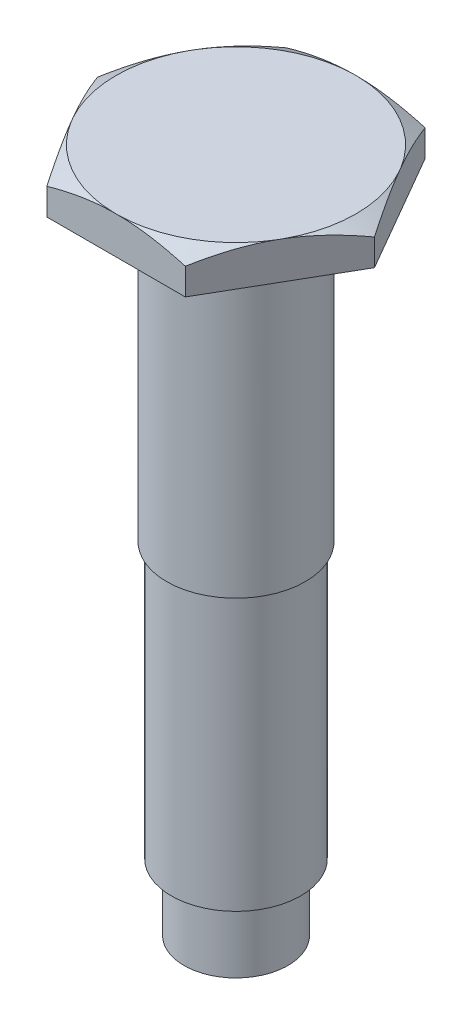
ISO-10303-21;
HEADER;
FILE_DESCRIPTION(('STEP AP214'),'2;1');
FILE_NAME('part.step','',(''),(''),'','','');
FILE_SCHEMA(('AUTOMOTIVE_DESIGN { 1 0 10303 214 1 1 1 1 }'));
ENDSEC;
DATA;
#1=APPLICATION_CONTEXT('core data for automotive mechanical design processes');
#2=APPLICATION_PROTOCOL_DEFINITION('international standard','automotive_design',2000,#1);
#3=PRODUCT_CONTEXT('',#1,'mechanical');
#4=PRODUCT('Part','Part','',(#3));
#5=PRODUCT_RELATED_PRODUCT_CATEGORY('part','',(#4));
#6=PRODUCT_DEFINITION_FORMATION('','',#4);
#7=PRODUCT_DEFINITION_CONTEXT('part definition',#1,'design');
#8=PRODUCT_DEFINITION('design','',#6,#7);
#9=PRODUCT_DEFINITION_SHAPE('','',#8);
#10=(LENGTH_UNIT() NAMED_UNIT(*) SI_UNIT(.MILLI.,.METRE.));
#11=(NAMED_UNIT(*) PLANE_ANGLE_UNIT() SI_UNIT($,.RADIAN.));
#12=(NAMED_UNIT(*) SI_UNIT($,.STERADIAN.) SOLID_ANGLE_UNIT());
#13=UNCERTAINTY_MEASURE_WITH_UNIT(LENGTH_MEASURE(1.E-05),#10,'distance_accuracy_value','');
#14=(GEOMETRIC_REPRESENTATION_CONTEXT(3) GLOBAL_UNCERTAINTY_ASSIGNED_CONTEXT((#13)) GLOBAL_UNIT_ASSIGNED_CONTEXT((#10,
#11,#12)) REPRESENTATION_CONTEXT('',''));
#15=CARTESIAN_POINT('',(0.,0.,0.));
#16=DIRECTION('',(0.,0.,1.));
#17=DIRECTION('',(1.,0.,0.));
#18=AXIS2_PLACEMENT_3D('',#15,#16,#17);
#19=CARTESIAN_POINT('',(0.,-24.3,0.));
#20=DIRECTION('',(0.,1.,0.));
#21=DIRECTION('',(0.,0.,1.));
#22=AXIS2_PLACEMENT_3D('',#19,#20,#21);
#23=CYLINDRICAL_SURFACE('',#22,2.425);
#24=CARTESIAN_POINT('',(0.,-11.5,0.));
#25=DIRECTION('',(0.,-1.,0.));
#26=DIRECTION('',(0.,0.,-1.));
#27=AXIS2_PLACEMENT_3D('',#24,#25,#26);
#28=CIRCLE('',#27,2.425);
#29=CARTESIAN_POINT('',(0.,-11.5,-2.425));
#30=VERTEX_POINT('',#29);
#31=EDGE_CURVE('E57',#30,#30,#28,.T.);
#32=ORIENTED_EDGE('',*,*,#31,.T.);
#33=EDGE_LOOP('',(#32));
#34=FACE_BOUND('',#33,.T.);
#35=CARTESIAN_POINT('',(0.,-21.8,0.));
#36=DIRECTION('',(0.,-1.,0.));
#37=DIRECTION('',(0.,0.,-1.));
#38=AXIS2_PLACEMENT_3D('',#35,#36,#37);
#39=CIRCLE('',#38,2.425);
#40=CARTESIAN_POINT('',(0.,-21.8,-2.425));
#41=VERTEX_POINT('',#40);
#42=EDGE_CURVE('E152',#41,#41,#39,.T.);
#43=ORIENTED_EDGE('',*,*,#42,.F.);
#44=EDGE_LOOP('',(#43));
#45=FACE_BOUND('',#44,.T.);
#46=ADVANCED_FACE('F52',(#34,#45),#23,.T.);
#47=CARTESIAN_POINT('',(0.,-21.8,0.));
#48=DIRECTION('',(0.,-1.,0.));
#49=DIRECTION('',(0.,0.,-1.));
#50=AXIS2_PLACEMENT_3D('',#47,#48,#49);
#51=PLANE('',#50);
#52=CARTESIAN_POINT('',(0.,-21.8,0.));
#53=DIRECTION('',(0.,-1.,0.));
#54=DIRECTION('',(0.,0.,-1.));
#55=AXIS2_PLACEMENT_3D('',#52,#53,#54);
#56=CIRCLE('',#55,1.95);
#57=CARTESIAN_POINT('',(0.,-21.8,-1.95));
#58=VERTEX_POINT('',#57);
#59=EDGE_CURVE('E204',#58,#58,#56,.T.);
#60=ORIENTED_EDGE('',*,*,#59,.F.);
#61=EDGE_LOOP('',(#60));
#62=FACE_BOUND('',#61,.T.);
#63=ORIENTED_EDGE('',*,*,#42,.T.);
#64=EDGE_LOOP('',(#63));
#65=FACE_BOUND('',#64,.T.);
#66=ADVANCED_FACE('F285',(#62,#65),#51,.T.);
#67=CARTESIAN_POINT('',(0.,-21.8,0.));
#68=DIRECTION('',(0.,-1.,0.));
#69=DIRECTION('',(0.,0.,-1.));
#70=AXIS2_PLACEMENT_3D('',#67,#68,#69);
#71=CYLINDRICAL_SURFACE('',#70,1.95);
#72=ORIENTED_EDGE('',*,*,#59,.T.);
#73=EDGE_LOOP('',(#72));
#74=FACE_BOUND('',#73,.T.);
#75=CARTESIAN_POINT('',(0.,-24.3,0.));
#76=DIRECTION('',(0.,-1.,0.));
#77=DIRECTION('',(0.,0.,-1.));
#78=AXIS2_PLACEMENT_3D('',#75,#76,#77);
#79=CIRCLE('',#78,1.95);
#80=CARTESIAN_POINT('',(0.,-24.3,-1.95));
#81=VERTEX_POINT('',#80);
#82=EDGE_CURVE('E208',#81,#81,#79,.T.);
#83=ORIENTED_EDGE('',*,*,#82,.F.);
#84=EDGE_LOOP('',(#83));
#85=FACE_BOUND('',#84,.T.);
#86=ADVANCED_FACE('F290',(#74,#85),#71,.T.);
#87=CARTESIAN_POINT('',(0.,-24.3,0.));
#88=DIRECTION('',(0.,-1.,0.));
#89=DIRECTION('',(0.,0.,-1.));
#90=AXIS2_PLACEMENT_3D('',#87,#88,#89);
#91=PLANE('',#90);
#92=ORIENTED_EDGE('',*,*,#82,.T.);
#93=EDGE_LOOP('',(#92));
#94=FACE_BOUND('',#93,.T.);
#95=ADVANCED_FACE('F305',(#94),#91,.T.);
#96=CARTESIAN_POINT('',(0.,-11.5,0.));
#97=DIRECTION('',(0.,1.,0.));
#98=DIRECTION('',(0.,0.,1.));
#99=AXIS2_PLACEMENT_3D('',#96,#97,#98);
#100=CYLINDRICAL_SURFACE('',#99,2.6);
#101=CARTESIAN_POINT('',(0.,-11.5,0.));
#102=DIRECTION('',(0.,-1.,0.));
#103=DIRECTION('',(0.,0.,-1.));
#104=AXIS2_PLACEMENT_3D('',#101,#102,#103);
#105=CIRCLE('',#104,2.6);
#106=CARTESIAN_POINT('',(0.,-11.5,-2.6));
#107=VERTEX_POINT('',#106);
#108=EDGE_CURVE('E215',#107,#107,#105,.T.);
#109=ORIENTED_EDGE('',*,*,#108,.F.);
#110=EDGE_LOOP('',(#109));
#111=FACE_BOUND('',#110,.T.);
#112=CARTESIAN_POINT('',(0.,0.,0.));
#113=DIRECTION('',(0.,1.,0.));
#114=DIRECTION('',(0.,0.,1.));
#115=AXIS2_PLACEMENT_3D('',#112,#113,#114);
#116=CIRCLE('',#115,2.6);
#117=CARTESIAN_POINT('',(0.,0.,2.6));
#118=VERTEX_POINT('',#117);
#119=EDGE_CURVE('E13',#118,#118,#116,.F.);
#120=ORIENTED_EDGE('',*,*,#119,.T.);
#121=EDGE_LOOP('',(#120));
#122=FACE_BOUND('',#121,.T.);
#123=ADVANCED_FACE('F302',(#111,#122),#100,.T.);
#124=CARTESIAN_POINT('',(0.,-11.5,0.));
#125=DIRECTION('',(0.,-1.,0.));
#126=DIRECTION('',(0.,0.,-1.));
#127=AXIS2_PLACEMENT_3D('',#124,#125,#126);
#128=PLANE('',#127);
#129=ORIENTED_EDGE('',*,*,#31,.F.);
#130=EDGE_LOOP('',(#129));
#131=FACE_BOUND('',#130,.T.);
#132=ORIENTED_EDGE('',*,*,#108,.T.);
#133=EDGE_LOOP('',(#132));
#134=FACE_BOUND('',#133,.T.);
#135=ADVANCED_FACE('F300',(#131,#134),#128,.T.);
#136=CARTESIAN_POINT('',(0.,1.4,0.));
#137=DIRECTION('',(0.,-1.,0.));
#138=DIRECTION('',(0.,0.,1.));
#139=AXIS2_PLACEMENT_3D('',#136,#137,#138);
#140=CONICAL_SURFACE('',#139,4.5,1.0471975511966);
#141=CARTESIAN_POINT('',(7.02775373223216,-0.454124789273065,3.17442258198759));
#142=CARTESIAN_POINT('',(6.94595929433924,-0.377433019190193,3.03275045978052));
#143=CARTESIAN_POINT('',(6.86397192725755,-0.30155195790506,2.89074417441623));
#144=CARTESIAN_POINT('',(6.69952996979118,-0.151791197053433,2.6059223491884));
#145=CARTESIAN_POINT('',(6.61707532405409,-0.077911740847407,2.46310671345166));
#146=CARTESIAN_POINT('',(6.45137969842866,0.0676733695980147,2.1761134712765));
#147=CARTESIAN_POINT('',(6.36813706970453,0.139371540587463,2.03193300897072));
#148=CARTESIAN_POINT('',(6.20103601612468,0.279831230371152,1.74250549417213));
#149=CARTESIAN_POINT('',(6.11717761031257,0.34859283953742,1.59725847466382));
#150=CARTESIAN_POINT('',(5.94650734955145,0.484316646401146,1.30164891168453));
#151=CARTESIAN_POINT('',(5.85967623869026,0.551182431909525,1.15125301599531));
#152=CARTESIAN_POINT('',(5.68515450522659,0.680257160061499,0.848972506611236));
#153=CARTESIAN_POINT('',(5.59746393147591,0.742466365668553,0.697087977530198));
#154=CARTESIAN_POINT('',(5.42118428204018,0.861080845971696,0.391762668367075));
#155=CARTESIAN_POINT('',(5.33259607284332,0.917491222644589,0.238323389086572));
#156=CARTESIAN_POINT('',(5.15437972767932,1.02322633098802,-0.0703563754767021));
#157=CARTESIAN_POINT('',(5.06475172504421,1.07255196051071,-0.225596629821623));
#158=CARTESIAN_POINT('',(4.85082306804145,1.17932065353719,-0.596131932945389));
#159=CARTESIAN_POINT('',(4.72602759238872,1.23295723560288,-0.812284037330647));
#160=CARTESIAN_POINT('',(4.53752606457053,1.29798014863304,-1.1387782608161));
#161=CARTESIAN_POINT('',(4.47447512583005,1.31708228871089,-1.24798569017953));
#162=CARTESIAN_POINT('',(4.34801396674504,1.34966788109555,-1.46702284289882));
#163=CARTESIAN_POINT('',(4.28460379499038,1.36315207572337,-1.57685248209455));
#164=CARTESIAN_POINT('',(4.15828769213079,1.3839969781063,-1.79563839006147));
#165=CARTESIAN_POINT('',(4.09538469304001,1.39142837342597,-1.90458958043515));
#166=CARTESIAN_POINT('',(3.96947258411831,1.40021353929659,-2.12267575037568));
#167=CARTESIAN_POINT('',(3.90646347607119,1.40156741101706,-2.23181072685288));
#168=CARTESIAN_POINT('',(3.78048582752106,1.39815550680156,-2.45001041475978));
#169=CARTESIAN_POINT('',(3.71751728766221,1.39338963597678,-2.55907512507373));
#170=CARTESIAN_POINT('',(3.59176321771671,1.37788386249752,-2.7768875634779));
#171=CARTESIAN_POINT('',(3.52897769997846,1.36714356571949,-2.88563527018006));
#172=CARTESIAN_POINT('',(3.38184879498638,1.33525044365775,-3.14047000888832));
#173=CARTESIAN_POINT('',(3.29763046050635,1.31177164019821,-3.28634044313656));
#174=CARTESIAN_POINT('',(3.12996898161369,1.25557216182377,-3.57673864305079));
#175=CARTESIAN_POINT('',(3.04652596068327,1.22285003995282,-3.72126619483932));
#176=CARTESIAN_POINT('',(2.88044748570321,1.14940005301191,-4.00892255154833));
#177=CARTESIAN_POINT('',(2.79781291904045,1.10866424445279,-4.15204981946966));
#178=CARTESIAN_POINT('',(2.63345665629373,1.02046987040766,-4.43672321708913));
#179=CARTESIAN_POINT('',(2.55173493552456,0.973011487190809,-4.57826938954329));
#180=CARTESIAN_POINT('',(2.38818083127617,0.871907470927306,-4.86155340788791));
#181=CARTESIAN_POINT('',(2.30635897781793,0.818194179899496,-5.00327301524705));
#182=CARTESIAN_POINT('',(2.14352201608778,0.706057896456654,-5.28531490631381));
#183=CARTESIAN_POINT('',(2.06250698720276,0.647634445633891,-5.42563705251932));
#184=CARTESIAN_POINT('',(1.90124979545261,0.526954778850262,-5.70494270171646));
#185=CARTESIAN_POINT('',(1.82100721779255,0.46470076988874,-5.84392692315397));
#186=CARTESIAN_POINT('',(1.66115763399711,0.337008626902662,-6.12079452385642));
#187=CARTESIAN_POINT('',(1.58155064445506,0.271570410062163,-6.25867787438085));
#188=CARTESIAN_POINT('',(1.43980016942041,0.152286187773572,-6.50419689913789));
#189=CARTESIAN_POINT('',(1.377550718594,0.098941958337579,-6.61201611071249));
#190=CARTESIAN_POINT('',(1.25336222128168,-0.00915825365951011,-6.82711689777307));
#191=CARTESIAN_POINT('',(1.19142316242206,-0.0639141794002777,-6.93439849469092));
#192=CARTESIAN_POINT('',(1.06855937024202,-0.173990162223895,-7.14720482515734));
#193=CARTESIAN_POINT('',(1.00763136561662,-0.229295639253394,-7.25273522477232));
#194=CARTESIAN_POINT('',(0.886015406996071,-0.340958275081432,-7.46338024411431));
#195=CARTESIAN_POINT('',(0.825327457022315,-0.397315451408355,-7.56849485687605));
#196=CARTESIAN_POINT('',(0.764746267767833,-0.454124789273058,-7.67342455464776));
#197=B_SPLINE_CURVE_WITH_KNOTS('',3,(#141,#142,#143,#144,#145,#146,#147,#148,#149,#150,#151,
#152,#153,#154,#155,#156,#157,#158,#159,#160,#161,#162,#163,#164,#165,#166,#167,#168,#169,#170,
#171,#172,#173,#174,#175,#176,#177,#178,#179,#180,#181,#182,#183,#184,#185,#186,#187,#188,#189,
#190,#191,#192,#193,#194,#195,#196),.UNSPECIFIED.,.F.,.F.,(4,2,2,2,2,2,2,2,2,2,2,2,2,2,2,2,2,2,
2,2,2,2,2,2,2,2,2,4),(0.,0.542026372178205,1.08411835228508,1.62789791735099,2.17166073564649,
2.72987716868045,3.28806205464704,3.84575155274402,4.40337031220445,5.16842888782534,
5.550946692113,5.9334139367919,6.31134777627518,6.68927532445916,7.06720873261636,
7.44516707540755,7.9550568160091,8.46502641941072,8.97550409574346,9.48596793414437,
10.0025821226153,10.5192466504577,11.0356162367859,11.5519992602125,11.9583277083475,
12.3646398273455,12.7660923087187,13.1675514869771),.UNSPECIFIED.);
#198=CARTESIAN_POINT('',(3.84886527144745,1.4,-2.33157374368596));
#199=VERTEX_POINT('',#198);
#200=CARTESIAN_POINT('',(2.5975,0.998741562913212,-4.49900197266016));
#201=VERTEX_POINT('',#200);
#202=EDGE_CURVE('E240',#199,#201,#197,.T.);
#203=ORIENTED_EDGE('',*,*,#202,.T.);
#204=CARTESIAN_POINT('',(5.77192258198759,-0.227090808716546,-4.49900197266016));
#205=CARTESIAN_POINT('',(5.60913755966845,-0.152984369439807,-4.49900197266016));
#206=CARTESIAN_POINT('',(5.44591300460618,-0.0798254228658757,-4.49900197266016));
#207=CARTESIAN_POINT('',(5.11839636806293,0.0641385338696213,-4.49900197266016));
#208=CARTESIAN_POINT('',(4.9541041050891,0.134943130618416,-4.49900197266016));
#209=CARTESIAN_POINT('',(4.62365019074874,0.273995214668935,-4.49900197266016));
#210=CARTESIAN_POINT('',(4.45748365552962,0.342231139729387,-4.49900197266016));
#211=CARTESIAN_POINT('',(4.12376096204262,0.475206584033677,-4.49900197266016));
#212=CARTESIAN_POINT('',(3.95620486637187,0.539946259800704,-4.49900197266016));
#213=CARTESIAN_POINT('',(3.62014094058057,0.664910495326106,-4.49900197266016));
#214=CARTESIAN_POINT('',(3.45163923170269,0.725151431085589,-4.49900197266016));
#215=CARTESIAN_POINT('',(3.11284465445949,0.840435342818388,-4.49900197266016));
#216=CARTESIAN_POINT('',(2.94255166995606,0.895477979420265,-4.49900197266016));
#217=CARTESIAN_POINT('',(2.60024415659692,0.999126538813837,-4.49900197266016));
#218=CARTESIAN_POINT('',(2.42823222054523,1.04774093062003,-4.49900197266016));
#219=CARTESIAN_POINT('',(2.08222141630835,1.1372651045468,-4.49900197266016));
#220=CARTESIAN_POINT('',(1.90822263490411,1.17817522181794,-4.49900197266016));
#221=CARTESIAN_POINT('',(1.48338106639456,1.26633205480424,-4.49900197266016));
#222=CARTESIAN_POINT('',(1.23149635233239,1.30880729595718,-4.49900197266016));
#223=CARTESIAN_POINT('',(0.851636268195707,1.35541796650651,-4.49900197266016));
#224=CARTESIAN_POINT('',(0.724677188925095,1.3681044984636,-4.49900197266016));
#225=CARTESIAN_POINT('',(0.470303771867612,1.38743553984244,-4.49900197266016));
#226=CARTESIAN_POINT('',(0.342889490864874,1.39408077816295,-4.49900197266016));
#227=CARTESIAN_POINT('',(0.0879655096792876,1.40111945511139,-4.49900197266016));
#228=CARTESIAN_POINT('',(-0.0395440862933155,1.40151666976282,-4.49900197266016));
#229=CARTESIAN_POINT('',(-0.294427215994776,1.39605864535107,-4.49900197266016));
#230=CARTESIAN_POINT('',(-0.421800750546122,1.39020344430019,-4.49900197266016));
#231=CARTESIAN_POINT('',(-0.67612009637022,1.37241909335192,-4.49900197266016));
#232=CARTESIAN_POINT('',(-0.803065911348346,1.36048999621015,-4.49900197266016));
#233=CARTESIAN_POINT('',(-1.05629749340669,1.33090647036077,-4.49900197266016));
#234=CARTESIAN_POINT('',(-1.18258313686381,1.3132510057949,-4.49900197266016));
#235=CARTESIAN_POINT('',(-1.69482776062332,1.23064719090392,-4.49900197266016));
#236=CARTESIAN_POINT('',(-2.07730821187047,1.14344279907834,-4.49900197266016));
#237=CARTESIAN_POINT('',(-2.64380905996445,0.986818585267799,-4.49900197266016));
#238=CARTESIAN_POINT('',(-2.83170917259291,0.930205673031296,-4.49900197266016));
#239=CARTESIAN_POINT('',(-3.20529209927546,0.810030633732534,-4.49900197266016));
#240=CARTESIAN_POINT('',(-3.39097508137221,0.746469037087198,-4.49900197266016));
#241=CARTESIAN_POINT('',(-3.76270287607295,0.612937713374495,-4.49900197266016));
#242=CARTESIAN_POINT('',(-3.94872142031268,0.542895859459579,-4.49900197266016));
#243=CARTESIAN_POINT('',(-4.3189879420537,0.398256135634828,-4.49900197266016));
#244=CARTESIAN_POINT('',(-4.50323580111474,0.323657963376374,-4.49900197266016));
#245=CARTESIAN_POINT('',(-4.86897004788675,0.171331942110032,-4.49900197266016));
#246=CARTESIAN_POINT('',(-5.05046667596422,0.0936285461315302,-4.49900197266016));
#247=CARTESIAN_POINT('',(-5.41212709767287,-0.064699465637042,-4.49900197266016));
#248=CARTESIAN_POINT('',(-5.59229122543423,-0.145323316986271,-4.49900197266016));
#249=CARTESIAN_POINT('',(-5.7719225819876,-0.227090808716548,-4.49900197266016));
#250=B_SPLINE_CURVE_WITH_KNOTS('',3,(#204,#205,#206,#207,#208,#209,#210,#211,#212,#213,#214,
#215,#216,#217,#218,#219,#220,#221,#222,#223,#224,#225,#226,#227,#228,#229,#230,#231,#232,#233,
#234,#235,#236,#237,#238,#239,#240,#241,#242,#243,#244,#245,#246,#247,#248,#249),.UNSPECIFIED.,
.F.,.F.,(4,2,2,2,2,2,2,2,2,2,2,2,2,2,2,2,2,2,2,2,2,2,4),(0.,0.536586650514957,1.07326703082519,
1.61212860577172,2.15096603645265,2.68773532632305,3.2245396350365,3.76062952038355,
4.29669607941342,5.06200202870462,5.44465629336931,5.827264383611,6.20964123390159,
6.59201575950021,6.97438696399191,7.35682737526941,8.53074642990351,9.11943237505045,
9.70807341511456,10.3043127706032,10.9005917344777,11.4928560768004,12.0849664961993),.UNSPECIFIED.);
#251=CARTESIAN_POINT('',(0.0947694571050346,1.4,-4.49900197266016));
#252=VERTEX_POINT('',#251);
#253=EDGE_CURVE('E333',#201,#252,#250,.T.);
#254=ORIENTED_EDGE('',*,*,#253,.T.);
#255=CARTESIAN_POINT('',(0.,1.4,0.));
#256=DIRECTION('',(0.,1.,0.));
#257=DIRECTION('',(0.,0.,1.));
#258=AXIS2_PLACEMENT_3D('',#255,#256,#257);
#259=CIRCLE('',#258,4.5);
#260=EDGE_CURVE('E349',#199,#252,#259,.T.);
#261=ORIENTED_EDGE('',*,*,#260,.F.);
#262=EDGE_LOOP('',(#203,#254,#261));
#263=FACE_BOUND('',#262,.T.);
#264=ADVANCED_FACE('F235',(#263),#140,.T.);
#265=CARTESIAN_POINT('',(-0.0947694571050331,1.4,-4.49900197266016));
#266=VERTEX_POINT('',#265);
#267=CARTESIAN_POINT('',(-2.59749999999996,0.998741562913258,-4.49900197266022));
#268=VERTEX_POINT('',#267);
#269=EDGE_CURVE('E260',#266,#268,#250,.T.);
#270=ORIENTED_EDGE('',*,*,#269,.T.);
#271=CARTESIAN_POINT('',(-0.764746267767833,-0.454124789273067,-7.67342455464776));
#272=CARTESIAN_POINT('',(-0.846540705660756,-0.377433019190196,-7.53175243244068));
#273=CARTESIAN_POINT('',(-0.928528072742443,-0.301551957905063,-7.3897461470764));
#274=CARTESIAN_POINT('',(-1.09297003020882,-0.151791197053435,-7.10492432184856));
#275=CARTESIAN_POINT('',(-1.17542467594591,-0.0779117408474092,-6.96210868611182));
#276=CARTESIAN_POINT('',(-1.34112030157134,0.0676733695980126,-6.67511544393666));
#277=CARTESIAN_POINT('',(-1.42436293029547,0.139371540587461,-6.53093498163088));
#278=CARTESIAN_POINT('',(-1.59146398387532,0.27983123037115,-6.24150746683229));
#279=CARTESIAN_POINT('',(-1.67532238968743,0.348592839537418,-6.09626044732398));
#280=CARTESIAN_POINT('',(-1.84599265044855,0.484316646401144,-5.80065088434469));
#281=CARTESIAN_POINT('',(-1.93282376130974,0.551182431909523,-5.65025498865547));
#282=CARTESIAN_POINT('',(-2.10734549477341,0.680257160061497,-5.3479744792714));
#283=CARTESIAN_POINT('',(-2.19503606852409,0.742466365668551,-5.19608995019036));
#284=CARTESIAN_POINT('',(-2.37131571795982,0.861080845971694,-4.89076464102724));
#285=CARTESIAN_POINT('',(-2.45990392715668,0.917491222644587,-4.73732536174674));
#286=CARTESIAN_POINT('',(-2.63812027232068,1.02322633098802,-4.42864559718346));
#287=CARTESIAN_POINT('',(-2.72774827495578,1.07255196051071,-4.27340534283854));
#288=CARTESIAN_POINT('',(-2.94167693195855,1.17932065353718,-3.90287003971478));
#289=CARTESIAN_POINT('',(-3.06647240761128,1.23295723560288,-3.68671793532952));
#290=CARTESIAN_POINT('',(-3.25497393542946,1.29798014863304,-3.36022371184407));
#291=CARTESIAN_POINT('',(-3.31802487416995,1.31708228871089,-3.25101628248064));
#292=CARTESIAN_POINT('',(-3.44448603325496,1.34966788109555,-3.03197912976134));
#293=CARTESIAN_POINT('',(-3.50789620500962,1.36315207572337,-2.92214949056561));
#294=CARTESIAN_POINT('',(-3.63421230786921,1.3839969781063,-2.7033635825987));
#295=CARTESIAN_POINT('',(-3.69711530695999,1.39142837342596,-2.59441239222502));
#296=CARTESIAN_POINT('',(-3.82302741588169,1.40021353929659,-2.37632622228448));
#297=CARTESIAN_POINT('',(-3.8860365239288,1.40156741101706,-2.26719124580728));
#298=CARTESIAN_POINT('',(-4.01201417247894,1.39815550680156,-2.04899155790039));
#299=CARTESIAN_POINT('',(-4.07498271233779,1.39338963597678,-1.93992684758643));
#300=CARTESIAN_POINT('',(-4.20073678228329,1.37788386249752,-1.72211440918227));
#301=CARTESIAN_POINT('',(-4.26352230002154,1.36714356571949,-1.6133667024801));
#302=CARTESIAN_POINT('',(-4.41065120501361,1.33525044365775,-1.35853196377185));
#303=CARTESIAN_POINT('',(-4.49486953949365,1.31177164019821,-1.2126615295236));
#304=CARTESIAN_POINT('',(-4.66253101838631,1.25557216182377,-0.922263329609371));
#305=CARTESIAN_POINT('',(-4.74597403931673,1.22285003995282,-0.77773577782085));
#306=CARTESIAN_POINT('',(-4.91205251429679,1.14940005301191,-0.490079421111832));
#307=CARTESIAN_POINT('',(-4.99468708095954,1.10866424445279,-0.346952153190502));
#308=CARTESIAN_POINT('',(-5.15904334370627,1.02046987040766,-0.062278755571036));
#309=CARTESIAN_POINT('',(-5.24076506447544,0.97301148719081,0.0792674168831205));
#310=CARTESIAN_POINT('',(-5.40431916872383,0.871907470927308,0.362551435227746));
#311=CARTESIAN_POINT('',(-5.48614102218207,0.818194179899498,0.50427104258688));
#312=CARTESIAN_POINT('',(-5.64897798391222,0.706057896456656,0.786312933653643));
#313=CARTESIAN_POINT('',(-5.72999301279723,0.647634445633894,0.926635079859152));
#314=CARTESIAN_POINT('',(-5.89125020454739,0.526954778850265,1.20594072905629));
#315=CARTESIAN_POINT('',(-5.97149278220745,0.464700769888743,1.34492495049381));
#316=CARTESIAN_POINT('',(-6.13134236600289,0.337008626902666,1.62179255119625));
#317=CARTESIAN_POINT('',(-6.21094935554493,0.271570410062167,1.75967590172068));
#318=CARTESIAN_POINT('',(-6.35269983057958,0.152286187773576,2.00519492647772));
#319=CARTESIAN_POINT('',(-6.41494928140599,0.0989419583375829,2.11301413805232));
#320=CARTESIAN_POINT('',(-6.53913777871832,-0.00915825365950742,2.3281149251129));
#321=CARTESIAN_POINT('',(-6.60107683757794,-0.0639141794002759,2.43539652203076));
#322=CARTESIAN_POINT('',(-6.72394062975798,-0.173990162223894,2.64820285249718));
#323=CARTESIAN_POINT('',(-6.78486863438338,-0.229295639253393,2.75373325211216));
#324=CARTESIAN_POINT('',(-6.90648459300393,-0.340958275081431,2.96437827145414));
#325=CARTESIAN_POINT('',(-6.96717254297768,-0.397315451408355,3.06949288421589));
#326=CARTESIAN_POINT('',(-7.02775373223217,-0.454124789273059,3.1744225819876));
#327=B_SPLINE_CURVE_WITH_KNOTS('',3,(#271,#272,#273,#274,#275,#276,#277,#278,#279,#280,#281,
#282,#283,#284,#285,#286,#287,#288,#289,#290,#291,#292,#293,#294,#295,#296,#297,#298,#299,#300,
#301,#302,#303,#304,#305,#306,#307,#308,#309,#310,#311,#312,#313,#314,#315,#316,#317,#318,#319,
#320,#321,#322,#323,#324,#325,#326),.UNSPECIFIED.,.F.,.F.,(4,2,2,2,2,2,2,2,2,2,2,2,2,2,2,2,2,2,
2,2,2,2,2,2,2,2,2,4),(0.,0.542026372178204,1.08411835228508,1.62789791735099,2.17166073564649,
2.72987716868045,3.28806205464704,3.84575155274402,4.40337031220445,5.16842888782534,
5.550946692113,5.9334139367919,6.31134777627518,6.68927532445916,7.06720873261636,
7.44516707540755,7.9550568160091,8.46502641941072,8.97550409574346,9.48596793414436,
10.0025821226153,10.5192466504577,11.0356162367859,11.5519992602125,11.9583277083475,
12.3646398273455,12.7660923087187,13.1675514869771),.UNSPECIFIED.);
#328=CARTESIAN_POINT('',(-3.84886527144748,1.4,-2.3315737436859));
#329=VERTEX_POINT('',#328);
#330=EDGE_CURVE('E259',#268,#329,#327,.T.);
#331=ORIENTED_EDGE('',*,*,#330,.T.);
#332=EDGE_CURVE('E345',#266,#329,#259,.T.);
#333=ORIENTED_EDGE('',*,*,#332,.F.);
#334=EDGE_LOOP('',(#270,#331,#333));
#335=FACE_BOUND('',#334,.T.);
#336=ADVANCED_FACE('F344',(#335),#140,.T.);
#337=CARTESIAN_POINT('',(-3.94363472855252,1.4,-2.16742822897426));
#338=VERTEX_POINT('',#337);
#339=CARTESIAN_POINT('',(-5.19500000000004,0.998741562913258,0.));
#340=VERTEX_POINT('',#339);
#341=EDGE_CURVE('E254',#338,#340,#327,.T.);
#342=ORIENTED_EDGE('',*,*,#341,.T.);
#343=CARTESIAN_POINT('',(-7.02775373223217,-0.454124789273066,-3.1744225819876));
#344=CARTESIAN_POINT('',(-6.94595929433924,-0.377433019190195,-3.03275045978052));
#345=CARTESIAN_POINT('',(-6.86397192725756,-0.301551957905062,-2.89074417441624));
#346=CARTESIAN_POINT('',(-6.69952996979118,-0.151791197053434,-2.6059223491884));
#347=CARTESIAN_POINT('',(-6.61707532405409,-0.077911740847408,-2.46310671345166));
#348=CARTESIAN_POINT('',(-6.45137969842866,0.0676733695980137,-2.1761134712765));
#349=CARTESIAN_POINT('',(-6.36813706970453,0.139371540587463,-2.03193300897072));
#350=CARTESIAN_POINT('',(-6.20103601612468,0.279831230371152,-1.74250549417213));
#351=CARTESIAN_POINT('',(-6.11717761031257,0.348592839537419,-1.59725847466382));
#352=CARTESIAN_POINT('',(-5.94650734955145,0.484316646401145,-1.30164891168453));
#353=CARTESIAN_POINT('',(-5.85967623869026,0.551182431909524,-1.15125301599531));
#354=CARTESIAN_POINT('',(-5.68515450522659,0.680257160061498,-0.848972506611238));
#355=CARTESIAN_POINT('',(-5.59746393147591,0.742466365668552,-0.6970879775302));
#356=CARTESIAN_POINT('',(-5.42118428204018,0.861080845971695,-0.391762668367077));
#357=CARTESIAN_POINT('',(-5.33259607284332,0.917491222644588,-0.238323389086575));
#358=CARTESIAN_POINT('',(-5.15437972767932,1.02322633098802,0.0703563754767001));
#359=CARTESIAN_POINT('',(-5.06475172504422,1.07255196051071,0.225596629821621));
#360=CARTESIAN_POINT('',(-4.85082306804145,1.17932065353719,0.596131932945387));
#361=CARTESIAN_POINT('',(-4.72602759238872,1.23295723560288,0.812284037330646));
#362=CARTESIAN_POINT('',(-4.53752606457053,1.29798014863304,1.13877826081609));
#363=CARTESIAN_POINT('',(-4.47447512583005,1.31708228871089,1.24798569017952));
#364=CARTESIAN_POINT('',(-4.34801396674504,1.34966788109555,1.46702284289882));
#365=CARTESIAN_POINT('',(-4.28460379499038,1.36315207572337,1.57685248209455));
#366=CARTESIAN_POINT('',(-4.15828769213079,1.3839969781063,1.79563839006146));
#367=CARTESIAN_POINT('',(-4.09538469304001,1.39142837342596,1.90458958043514));
#368=CARTESIAN_POINT('',(-3.96947258411831,1.40021353929659,2.12267575037568));
#369=CARTESIAN_POINT('',(-3.90646347607119,1.40156741101706,2.23181072685288));
#370=CARTESIAN_POINT('',(-3.78048582752106,1.39815550680156,2.45001041475978));
#371=CARTESIAN_POINT('',(-3.71751728766221,1.39338963597678,2.55907512507373));
#372=CARTESIAN_POINT('',(-3.59176321771671,1.37788386249752,2.7768875634779));
#373=CARTESIAN_POINT('',(-3.52897769997846,1.36714356571949,2.88563527018006));
#374=CARTESIAN_POINT('',(-3.38184879498639,1.33525044365775,3.14047000888832));
#375=CARTESIAN_POINT('',(-3.29763046050635,1.31177164019821,3.28634044313656));
#376=CARTESIAN_POINT('',(-3.12996898161369,1.25557216182377,3.5767386430508));
#377=CARTESIAN_POINT('',(-3.04652596068327,1.22285003995282,3.72126619483932));
#378=CARTESIAN_POINT('',(-2.88044748570321,1.14940005301191,4.00892255154833));
#379=CARTESIAN_POINT('',(-2.79781291904045,1.10866424445279,4.15204981946966));
#380=CARTESIAN_POINT('',(-2.63345665629373,1.02046987040766,4.43672321708913));
#381=CARTESIAN_POINT('',(-2.55173493552456,0.973011487190808,4.57826938954329));
#382=CARTESIAN_POINT('',(-2.38818083127617,0.871907470927305,4.86155340788791));
#383=CARTESIAN_POINT('',(-2.30635897781793,0.818194179899496,5.00327301524705));
#384=CARTESIAN_POINT('',(-2.14352201608778,0.706057896456654,5.28531490631381));
#385=CARTESIAN_POINT('',(-2.06250698720277,0.647634445633891,5.42563705251932));
#386=CARTESIAN_POINT('',(-1.90124979545261,0.526954778850262,5.70494270171646));
#387=CARTESIAN_POINT('',(-1.82100721779255,0.46470076988874,5.84392692315397));
#388=CARTESIAN_POINT('',(-1.66115763399711,0.337008626902662,6.12079452385642));
#389=CARTESIAN_POINT('',(-1.58155064445507,0.271570410062163,6.25867787438085));
#390=CARTESIAN_POINT('',(-1.43980016942041,0.152286187773572,6.50419689913789));
#391=CARTESIAN_POINT('',(-1.37755071859401,0.0989419583375785,6.61201611071249));
#392=CARTESIAN_POINT('',(-1.25336222128168,-0.00915825365951057,6.82711689777307));
#393=CARTESIAN_POINT('',(-1.19142316242206,-0.0639141794002782,6.93439849469093));
#394=CARTESIAN_POINT('',(-1.06855937024202,-0.173990162223895,7.14720482515734));
#395=CARTESIAN_POINT('',(-1.00763136561662,-0.229295639253394,7.25273522477232));
#396=CARTESIAN_POINT('',(-0.886015406996073,-0.340958275081431,7.46338024411431));
#397=CARTESIAN_POINT('',(-0.825327457022317,-0.397315451408355,7.56849485687605));
#398=CARTESIAN_POINT('',(-0.764746267767834,-0.454124789273058,7.67342455464776));
#399=B_SPLINE_CURVE_WITH_KNOTS('',3,(#343,#344,#345,#346,#347,#348,#349,#350,#351,#352,#353,
#354,#355,#356,#357,#358,#359,#360,#361,#362,#363,#364,#365,#366,#367,#368,#369,#370,#371,#372,
#373,#374,#375,#376,#377,#378,#379,#380,#381,#382,#383,#384,#385,#386,#387,#388,#389,#390,#391,
#392,#393,#394,#395,#396,#397,#398),.UNSPECIFIED.,.F.,.F.,(4,2,2,2,2,2,2,2,2,2,2,2,2,2,2,2,2,2,
2,2,2,2,2,2,2,2,2,4),(0.,0.542026372178205,1.08411835228508,1.62789791735099,2.17166073564649,
2.72987716868045,3.28806205464704,3.84575155274403,4.40337031220445,5.16842888782534,
5.550946692113,5.9334139367919,6.31134777627519,6.68927532445917,7.06720873261637,
7.44516707540755,7.95505681600911,8.46502641941073,8.97550409574347,9.48596793414437,
10.0025821226153,10.5192466504577,11.0356162367859,11.5519992602125,11.9583277083475,
12.3646398273455,12.7660923087187,13.1675514869771),.UNSPECIFIED.);
#400=CARTESIAN_POINT('',(-3.94363472855252,1.4,2.16742822897426));
#401=VERTEX_POINT('',#400);
#402=EDGE_CURVE('E77',#340,#401,#399,.T.);
#403=ORIENTED_EDGE('',*,*,#402,.T.);
#404=EDGE_CURVE('E202',#338,#401,#259,.T.);
#405=ORIENTED_EDGE('',*,*,#404,.F.);
#406=EDGE_LOOP('',(#342,#403,#405));
#407=FACE_BOUND('',#406,.T.);
#408=ADVANCED_FACE('F357',(#407),#140,.T.);
#409=CARTESIAN_POINT('',(-3.84886527144748,1.4,2.3315737436859));
#410=VERTEX_POINT('',#409);
#411=CARTESIAN_POINT('',(-2.5975,0.998741562913212,4.49900197266016));
#412=VERTEX_POINT('',#411);
#413=EDGE_CURVE('E249',#410,#412,#399,.T.);
#414=ORIENTED_EDGE('',*,*,#413,.T.);
#415=CARTESIAN_POINT('',(-5.7719225819876,-0.227090808716547,4.49900197266016));
#416=CARTESIAN_POINT('',(-5.60913755966845,-0.152984369439808,4.49900197266016));
#417=CARTESIAN_POINT('',(-5.44591300460618,-0.0798254228658768,4.49900197266016));
#418=CARTESIAN_POINT('',(-5.11839636806293,0.0641385338696201,4.49900197266016));
#419=CARTESIAN_POINT('',(-4.95410410508911,0.134943130618415,4.49900197266016));
#420=CARTESIAN_POINT('',(-4.62365019074875,0.273995214668933,4.49900197266016));
#421=CARTESIAN_POINT('',(-4.45748365552963,0.342231139729385,4.49900197266016));
#422=CARTESIAN_POINT('',(-4.12376096204263,0.475206584033675,4.49900197266016));
#423=CARTESIAN_POINT('',(-3.95620486637188,0.539946259800702,4.49900197266016));
#424=CARTESIAN_POINT('',(-3.62014094058057,0.664910495326105,4.49900197266016));
#425=CARTESIAN_POINT('',(-3.4516392317027,0.725151431085589,4.49900197266016));
#426=CARTESIAN_POINT('',(-3.11284465445949,0.840435342818387,4.49900197266016));
#427=CARTESIAN_POINT('',(-2.94255166995606,0.895477979420264,4.49900197266016));
#428=CARTESIAN_POINT('',(-2.60024415659692,0.999126538813836,4.49900197266016));
#429=CARTESIAN_POINT('',(-2.42823222054524,1.04774093062003,4.49900197266016));
#430=CARTESIAN_POINT('',(-2.08222141630835,1.1372651045468,4.49900197266016));
#431=CARTESIAN_POINT('',(-1.90822263490412,1.17817522181794,4.49900197266016));
#432=CARTESIAN_POINT('',(-1.48338106639457,1.26633205480424,4.49900197266016));
#433=CARTESIAN_POINT('',(-1.2314963523324,1.30880729595718,4.49900197266016));
#434=CARTESIAN_POINT('',(-0.851636268195712,1.35541796650651,4.49900197266016));
#435=CARTESIAN_POINT('',(-0.724677188925101,1.3681044984636,4.49900197266016));
#436=CARTESIAN_POINT('',(-0.470303771867617,1.38743553984244,4.49900197266016));
#437=CARTESIAN_POINT('',(-0.342889490864879,1.39408077816295,4.49900197266016));
#438=CARTESIAN_POINT('',(-0.0879655096792928,1.40111945511139,4.49900197266016));
#439=CARTESIAN_POINT('',(0.0395440862933101,1.40151666976282,4.49900197266016));
#440=CARTESIAN_POINT('',(0.29442721599477,1.39605864535107,4.49900197266016));
#441=CARTESIAN_POINT('',(0.421800750546116,1.39020344430019,4.49900197266016));
#442=CARTESIAN_POINT('',(0.676120096370215,1.37241909335192,4.49900197266016));
#443=CARTESIAN_POINT('',(0.803065911348341,1.36048999621015,4.49900197266016));
#444=CARTESIAN_POINT('',(1.05629749340669,1.33090647036077,4.49900197266016));
#445=CARTESIAN_POINT('',(1.18258313686381,1.3132510057949,4.49900197266016));
#446=CARTESIAN_POINT('',(1.69482776062331,1.23064719090393,4.49900197266016));
#447=CARTESIAN_POINT('',(2.07730821187046,1.14344279907834,4.49900197266016));
#448=CARTESIAN_POINT('',(2.64380905996445,0.9868185852678,4.49900197266016));
#449=CARTESIAN_POINT('',(2.8317091725929,0.930205673031297,4.49900197266016));
#450=CARTESIAN_POINT('',(3.20529209927546,0.810030633732535,4.49900197266016));
#451=CARTESIAN_POINT('',(3.39097508137221,0.746469037087199,4.49900197266016));
#452=CARTESIAN_POINT('',(3.76270287607295,0.612937713374496,4.49900197266016));
#453=CARTESIAN_POINT('',(3.94872142031268,0.54289585945958,4.49900197266016));
#454=CARTESIAN_POINT('',(4.3189879420537,0.398256135634829,4.49900197266016));
#455=CARTESIAN_POINT('',(4.50323580111474,0.323657963376375,4.49900197266016));
#456=CARTESIAN_POINT('',(4.86897004788674,0.171331942110033,4.49900197266016));
#457=CARTESIAN_POINT('',(5.05046667596422,0.0936285461315312,4.49900197266016));
#458=CARTESIAN_POINT('',(5.41212709767287,-0.0646994656370415,4.49900197266016));
#459=CARTESIAN_POINT('',(5.59229122543423,-0.145323316986271,4.49900197266016));
#460=CARTESIAN_POINT('',(5.7719225819876,-0.227090808716548,4.49900197266016));
#461=B_SPLINE_CURVE_WITH_KNOTS('',3,(#415,#416,#417,#418,#419,#420,#421,#422,#423,#424,#425,
#426,#427,#428,#429,#430,#431,#432,#433,#434,#435,#436,#437,#438,#439,#440,#441,#442,#443,#444,
#445,#446,#447,#448,#449,#450,#451,#452,#453,#454,#455,#456,#457,#458,#459,#460),.UNSPECIFIED.,
.F.,.F.,(4,2,2,2,2,2,2,2,2,2,2,2,2,2,2,2,2,2,2,2,2,2,4),(0.,0.536586650514957,1.07326703082519,
1.61212860577171,2.15096603645264,2.68773532632304,3.2245396350365,3.76062952038355,
4.29669607941342,5.06200202870461,5.44465629336931,5.827264383611,6.20964123390159,
6.59201575950021,6.97438696399191,7.35682737526941,8.53074642990351,9.11943237505045,
9.70807341511456,10.3043127706033,10.9005917344777,11.4928560768004,12.0849664961993),.UNSPECIFIED.);
#462=CARTESIAN_POINT('',(-0.0947694571050353,1.4,4.49900197266016));
#463=VERTEX_POINT('',#462);
#464=EDGE_CURVE('E69',#412,#463,#461,.T.);
#465=ORIENTED_EDGE('',*,*,#464,.T.);
#466=EDGE_CURVE('E164',#410,#463,#259,.T.);
#467=ORIENTED_EDGE('',*,*,#466,.F.);
#468=EDGE_LOOP('',(#414,#465,#467));
#469=FACE_BOUND('',#468,.T.);
#470=ADVANCED_FACE('F282',(#469),#140,.T.);
#471=CARTESIAN_POINT('',(0.,1.4,0.));
#472=DIRECTION('',(0.,1.,0.));
#473=DIRECTION('',(0.,0.,1.));
#474=AXIS2_PLACEMENT_3D('',#471,#472,#473);
#475=PLANE('',#474);
#476=DIRECTION('',(1.,0.,0.));
#477=VECTOR('',#476,1.);
#478=CARTESIAN_POINT('',(-2.5975,1.4,4.49900197266016));
#479=LINE('',#478,#477);
#480=CARTESIAN_POINT('',(0.0947694571050323,1.4,4.49900197266016));
#481=VERTEX_POINT('',#480);
#482=EDGE_CURVE('E158',#463,#481,#479,.T.);
#483=ORIENTED_EDGE('',*,*,#482,.T.);
#484=CARTESIAN_POINT('',(0.,1.4,0.));
#485=DIRECTION('',(0.,1.,0.));
#486=DIRECTION('',(0.,0.,1.));
#487=AXIS2_PLACEMENT_3D('',#484,#485,#486);
#488=CIRCLE('',#487,4.5);
#489=CARTESIAN_POINT('',(3.84886527144745,1.4,2.33157374368596));
#490=VERTEX_POINT('',#489);
#491=EDGE_CURVE('E142',#481,#490,#488,.T.);
#492=ORIENTED_EDGE('',*,*,#491,.T.);
#493=DIRECTION('',(0.5,0.,-0.866025403784439));
#494=VECTOR('',#493,1.);
#495=CARTESIAN_POINT('',(2.5975,1.4,4.49900197266016));
#496=LINE('',#495,#494);
#497=CARTESIAN_POINT('',(3.94363472855255,1.4,2.1674282289742));
#498=VERTEX_POINT('',#497);
#499=EDGE_CURVE('E190',#490,#498,#496,.T.);
#500=ORIENTED_EDGE('',*,*,#499,.T.);
#501=CARTESIAN_POINT('',(3.94363472855255,1.4,-2.1674282289742));
#502=VERTEX_POINT('',#501);
#503=EDGE_CURVE('E62',#498,#502,#259,.T.);
#504=ORIENTED_EDGE('',*,*,#503,.T.);
#505=DIRECTION('',(-0.5,0.,-0.866025403784439));
#506=VECTOR('',#505,1.);
#507=CARTESIAN_POINT('',(5.195,1.4,0.));
#508=LINE('',#507,#506);
#509=EDGE_CURVE('E338',#502,#199,#508,.T.);
#510=ORIENTED_EDGE('',*,*,#509,.T.);
#511=ORIENTED_EDGE('',*,*,#260,.T.);
#512=DIRECTION('',(-1.,0.,0.));
#513=VECTOR('',#512,1.);
#514=CARTESIAN_POINT('',(2.5975,1.4,-4.49900197266016));
#515=LINE('',#514,#513);
#516=EDGE_CURVE('E348',#252,#266,#515,.T.);
#517=ORIENTED_EDGE('',*,*,#516,.T.);
#518=ORIENTED_EDGE('',*,*,#332,.T.);
#519=DIRECTION('',(-0.5,0.,0.866025403784439));
#520=VECTOR('',#519,1.);
#521=CARTESIAN_POINT('',(-2.5975,1.4,-4.49900197266016));
#522=LINE('',#521,#520);
#523=EDGE_CURVE('E169',#329,#338,#522,.T.);
#524=ORIENTED_EDGE('',*,*,#523,.T.);
#525=ORIENTED_EDGE('',*,*,#404,.T.);
#526=DIRECTION('',(0.5,0.,0.866025403784439));
#527=VECTOR('',#526,1.);
#528=CARTESIAN_POINT('',(-5.195,1.4,0.));
#529=LINE('',#528,#527);
#530=EDGE_CURVE('E165',#401,#410,#529,.T.);
#531=ORIENTED_EDGE('',*,*,#530,.T.);
#532=ORIENTED_EDGE('',*,*,#466,.T.);
#533=EDGE_LOOP('',(#483,#492,#500,#504,#510,#511,#517,#518,#524,#525,#531,#532));
#534=FACE_BOUND('',#533,.T.);
#535=ADVANCED_FACE('F162',(#534),#475,.T.);
#536=CARTESIAN_POINT('',(0.764746267767835,-0.454124789273067,7.67342455464776));
#537=CARTESIAN_POINT('',(0.846540705660757,-0.377433019190196,7.53175243244068));
#538=CARTESIAN_POINT('',(0.928528072742444,-0.301551957905063,7.3897461470764));
#539=CARTESIAN_POINT('',(1.09297003020882,-0.151791197053435,7.10492432184856));
#540=CARTESIAN_POINT('',(1.17542467594591,-0.0779117408474091,6.96210868611182));
#541=CARTESIAN_POINT('',(1.34112030157134,0.0676733695980131,6.67511544393666));
#542=CARTESIAN_POINT('',(1.42436293029547,0.139371540587462,6.53093498163088));
#543=CARTESIAN_POINT('',(1.59146398387532,0.279831230371151,6.24150746683229));
#544=CARTESIAN_POINT('',(1.67532238968743,0.348592839537418,6.09626044732398));
#545=CARTESIAN_POINT('',(1.84599265044855,0.484316646401144,5.80065088434469));
#546=CARTESIAN_POINT('',(1.93282376130974,0.551182431909523,5.65025498865547));
#547=CARTESIAN_POINT('',(2.10734549477341,0.680257160061498,5.3479744792714));
#548=CARTESIAN_POINT('',(2.19503606852409,0.742466365668551,5.19608995019036));
#549=CARTESIAN_POINT('',(2.37131571795982,0.861080845971694,4.89076464102724));
#550=CARTESIAN_POINT('',(2.45990392715668,0.917491222644587,4.73732536174674));
#551=CARTESIAN_POINT('',(2.63812027232068,1.02322633098802,4.42864559718346));
#552=CARTESIAN_POINT('',(2.72774827495578,1.07255196051071,4.27340534283854));
#553=CARTESIAN_POINT('',(2.94167693195855,1.17932065353719,3.90287003971477));
#554=CARTESIAN_POINT('',(3.06647240761128,1.23295723560288,3.68671793532951));
#555=CARTESIAN_POINT('',(3.25497393542946,1.29798014863304,3.36022371184407));
#556=CARTESIAN_POINT('',(3.31802487416995,1.31708228871089,3.25101628248064));
#557=CARTESIAN_POINT('',(3.44448603325496,1.34966788109555,3.03197912976134));
#558=CARTESIAN_POINT('',(3.50789620500962,1.36315207572337,2.92214949056561));
#559=CARTESIAN_POINT('',(3.63421230786921,1.3839969781063,2.7033635825987));
#560=CARTESIAN_POINT('',(3.69711530695999,1.39142837342597,2.59441239222501));
#561=CARTESIAN_POINT('',(3.82302741588169,1.40021353929659,2.37632622228448));
#562=CARTESIAN_POINT('',(3.88603652392881,1.40156741101706,2.26719124580728));
#563=CARTESIAN_POINT('',(4.01201417247894,1.39815550680156,2.04899155790038));
#564=CARTESIAN_POINT('',(4.07498271233779,1.39338963597678,1.93992684758643));
#565=CARTESIAN_POINT('',(4.20073678228329,1.37788386249752,1.72211440918226));
#566=CARTESIAN_POINT('',(4.26352230002154,1.36714356571949,1.6133667024801));
#567=CARTESIAN_POINT('',(4.41065120501361,1.33525044365775,1.35853196377184));
#568=CARTESIAN_POINT('',(4.49486953949365,1.31177164019821,1.2126615295236));
#569=CARTESIAN_POINT('',(4.66253101838631,1.25557216182377,0.922263329609364));
#570=CARTESIAN_POINT('',(4.74597403931673,1.22285003995282,0.777735777820844));
#571=CARTESIAN_POINT('',(4.91205251429679,1.14940005301191,0.490079421111826));
#572=CARTESIAN_POINT('',(4.99468708095955,1.10866424445279,0.346952153190496));
#573=CARTESIAN_POINT('',(5.15904334370627,1.02046987040766,0.0622787555710296));
#574=CARTESIAN_POINT('',(5.24076506447544,0.973011487190809,-0.0792674168831269));
#575=CARTESIAN_POINT('',(5.40431916872383,0.871907470927307,-0.362551435227752));
#576=CARTESIAN_POINT('',(5.48614102218207,0.818194179899497,-0.504271042586887));
#577=CARTESIAN_POINT('',(5.64897798391222,0.706057896456655,-0.786312933653649));
#578=CARTESIAN_POINT('',(5.72999301279723,0.647634445633892,-0.926635079859158));
#579=CARTESIAN_POINT('',(5.89125020454739,0.526954778850263,-1.2059407290563));
#580=CARTESIAN_POINT('',(5.97149278220745,0.464700769888742,-1.34492495049381));
#581=CARTESIAN_POINT('',(6.13134236600289,0.337008626902665,-1.62179255119626));
#582=CARTESIAN_POINT('',(6.21094935554493,0.271570410062166,-1.75967590172068));
#583=CARTESIAN_POINT('',(6.35269983057958,0.152286187773574,-2.00519492647773));
#584=CARTESIAN_POINT('',(6.41494928140599,0.0989419583375809,-2.11301413805233));
#585=CARTESIAN_POINT('',(6.53913777871832,-0.00915825365950849,-2.32811492511291));
#586=CARTESIAN_POINT('',(6.60107683757794,-0.063914179400276,-2.43539652203077));
#587=CARTESIAN_POINT('',(6.72394062975798,-0.173990162223894,-2.64820285249718));
#588=CARTESIAN_POINT('',(6.78486863438338,-0.229295639253393,-2.75373325211216));
#589=CARTESIAN_POINT('',(6.90648459300393,-0.340958275081431,-2.96437827145415));
#590=CARTESIAN_POINT('',(6.96717254297768,-0.397315451408354,-3.06949288421589));
#591=CARTESIAN_POINT('',(7.02775373223217,-0.454124789273058,-3.1744225819876));
#592=B_SPLINE_CURVE_WITH_KNOTS('',3,(#536,#537,#538,#539,#540,#541,#542,#543,#544,#545,#546,
#547,#548,#549,#550,#551,#552,#553,#554,#555,#556,#557,#558,#559,#560,#561,#562,#563,#564,#565,
#566,#567,#568,#569,#570,#571,#572,#573,#574,#575,#576,#577,#578,#579,#580,#581,#582,#583,#584,
#585,#586,#587,#588,#589,#590,#591),.UNSPECIFIED.,.F.,.F.,(4,2,2,2,2,2,2,2,2,2,2,2,2,2,2,2,2,2,
2,2,2,2,2,2,2,2,2,4),(0.,0.542026372178204,1.08411835228508,1.62789791735099,2.17166073564649,
2.72987716868045,3.28806205464704,3.84575155274402,4.40337031220445,5.16842888782534,
5.550946692113,5.9334139367919,6.31134777627519,6.68927532445917,7.06720873261637,
7.44516707540755,7.95505681600911,8.46502641941073,8.97550409574346,9.48596793414437,
10.0025821226153,10.5192466504577,11.0356162367859,11.5519992602125,11.9583277083475,
12.3646398273455,12.7660923087187,13.1675514869771),.UNSPECIFIED.);
#593=CARTESIAN_POINT('',(5.19500000000003,0.998741562913259,0.));
#594=VERTEX_POINT('',#593);
#595=EDGE_CURVE('E177',#498,#594,#592,.T.);
#596=ORIENTED_EDGE('',*,*,#595,.T.);
#597=EDGE_CURVE('E336',#594,#502,#197,.T.);
#598=ORIENTED_EDGE('',*,*,#597,.T.);
#599=ORIENTED_EDGE('',*,*,#503,.F.);
#600=EDGE_LOOP('',(#596,#598,#599));
#601=FACE_BOUND('',#600,.T.);
#602=ADVANCED_FACE('F229',(#601),#140,.T.);
#603=CARTESIAN_POINT('',(2.5975,0.998741562913211,4.49900197266016));
#604=VERTEX_POINT('',#603);
#605=EDGE_CURVE('E147',#604,#490,#592,.T.);
#606=ORIENTED_EDGE('',*,*,#605,.T.);
#607=ORIENTED_EDGE('',*,*,#491,.F.);
#608=EDGE_CURVE('E145',#481,#604,#461,.T.);
#609=ORIENTED_EDGE('',*,*,#608,.T.);
#610=EDGE_LOOP('',(#606,#607,#609));
#611=FACE_BOUND('',#610,.T.);
#612=ADVANCED_FACE('F144',(#611),#140,.T.);
#613=CARTESIAN_POINT('',(5.195,1.4,0.));
#614=DIRECTION('',(-0.866025403784439,0.,0.5));
#615=DIRECTION('',(0.5,0.,0.866025403784439));
#616=AXIS2_PLACEMENT_3D('',#613,#614,#615);
#617=PLANE('',#616);
#618=ORIENTED_EDGE('',*,*,#597,.F.);
#619=DIRECTION('',(0.,-1.,0.));
#620=VECTOR('',#619,1.);
#621=CARTESIAN_POINT('',(5.195,1.4,0.));
#622=LINE('',#621,#620);
#623=CARTESIAN_POINT('',(5.195,0.,0.));
#624=VERTEX_POINT('',#623);
#625=EDGE_CURVE('E199',#594,#624,#622,.T.);
#626=ORIENTED_EDGE('',*,*,#625,.T.);
#627=DIRECTION('',(-0.5,0.,-0.866025403784439));
#628=VECTOR('',#627,1.);
#629=CARTESIAN_POINT('',(5.195,0.,0.));
#630=LINE('',#629,#628);
#631=CARTESIAN_POINT('',(2.5975,0.,-4.49900197266016));
#632=VERTEX_POINT('',#631);
#633=EDGE_CURVE('E176',#624,#632,#630,.T.);
#634=ORIENTED_EDGE('',*,*,#633,.T.);
#635=DIRECTION('',(0.,-1.,0.));
#636=VECTOR('',#635,1.);
#637=CARTESIAN_POINT('',(2.5975,1.4,-4.49900197266016));
#638=LINE('',#637,#636);
#639=EDGE_CURVE('E197',#201,#632,#638,.T.);
#640=ORIENTED_EDGE('',*,*,#639,.F.);
#641=ORIENTED_EDGE('',*,*,#202,.F.);
#642=ORIENTED_EDGE('',*,*,#509,.F.);
#643=EDGE_LOOP('',(#618,#626,#634,#640,#641,#642));
#644=FACE_BOUND('',#643,.T.);
#645=ADVANCED_FACE('F274',(#644),#617,.F.);
#646=CARTESIAN_POINT('',(2.5975,1.4,-4.49900197266016));
#647=DIRECTION('',(0.,0.,1.));
#648=DIRECTION('',(1.,0.,0.));
#649=AXIS2_PLACEMENT_3D('',#646,#647,#648);
#650=PLANE('',#649);
#651=ORIENTED_EDGE('',*,*,#253,.F.);
#652=ORIENTED_EDGE('',*,*,#639,.T.);
#653=DIRECTION('',(-1.,0.,0.));
#654=VECTOR('',#653,1.);
#655=CARTESIAN_POINT('',(2.5975,0.,-4.49900197266016));
#656=LINE('',#655,#654);
#657=CARTESIAN_POINT('',(-2.5975,0.,-4.49900197266016));
#658=VERTEX_POINT('',#657);
#659=EDGE_CURVE('E180',#632,#658,#656,.T.);
#660=ORIENTED_EDGE('',*,*,#659,.T.);
#661=DIRECTION('',(0.,-1.,0.));
#662=VECTOR('',#661,1.);
#663=CARTESIAN_POINT('',(-2.5975,1.4,-4.49900197266016));
#664=LINE('',#663,#662);
#665=EDGE_CURVE('E195',#268,#658,#664,.T.);
#666=ORIENTED_EDGE('',*,*,#665,.F.);
#667=ORIENTED_EDGE('',*,*,#269,.F.);
#668=ORIENTED_EDGE('',*,*,#516,.F.);
#669=EDGE_LOOP('',(#651,#652,#660,#666,#667,#668));
#670=FACE_BOUND('',#669,.T.);
#671=ADVANCED_FACE('F269',(#670),#650,.F.);
#672=CARTESIAN_POINT('',(-2.5975,1.4,-4.49900197266016));
#673=DIRECTION('',(0.866025403784439,0.,0.5));
#674=DIRECTION('',(0.5,0.,-0.866025403784439));
#675=AXIS2_PLACEMENT_3D('',#672,#673,#674);
#676=PLANE('',#675);
#677=ORIENTED_EDGE('',*,*,#330,.F.);
#678=ORIENTED_EDGE('',*,*,#665,.T.);
#679=DIRECTION('',(-0.5,0.,0.866025403784439));
#680=VECTOR('',#679,1.);
#681=CARTESIAN_POINT('',(-2.5975,0.,-4.49900197266016));
#682=LINE('',#681,#680);
#683=CARTESIAN_POINT('',(-5.195,0.,0.));
#684=VERTEX_POINT('',#683);
#685=EDGE_CURVE('E183',#658,#684,#682,.T.);
#686=ORIENTED_EDGE('',*,*,#685,.T.);
#687=DIRECTION('',(0.,-1.,0.));
#688=VECTOR('',#687,1.);
#689=CARTESIAN_POINT('',(-5.195,1.4,0.));
#690=LINE('',#689,#688);
#691=EDGE_CURVE('E193',#340,#684,#690,.T.);
#692=ORIENTED_EDGE('',*,*,#691,.F.);
#693=ORIENTED_EDGE('',*,*,#341,.F.);
#694=ORIENTED_EDGE('',*,*,#523,.F.);
#695=EDGE_LOOP('',(#677,#678,#686,#692,#693,#694));
#696=FACE_BOUND('',#695,.T.);
#697=ADVANCED_FACE('F265',(#696),#676,.F.);
#698=CARTESIAN_POINT('',(-5.195,1.4,0.));
#699=DIRECTION('',(0.866025403784439,0.,-0.5));
#700=DIRECTION('',(-0.5,0.,-0.866025403784439));
#701=AXIS2_PLACEMENT_3D('',#698,#699,#700);
#702=PLANE('',#701);
#703=ORIENTED_EDGE('',*,*,#402,.F.);
#704=ORIENTED_EDGE('',*,*,#691,.T.);
#705=DIRECTION('',(0.5,0.,0.866025403784439));
#706=VECTOR('',#705,1.);
#707=CARTESIAN_POINT('',(-5.195,0.,0.));
#708=LINE('',#707,#706);
#709=CARTESIAN_POINT('',(-2.5975,0.,4.49900197266016));
#710=VERTEX_POINT('',#709);
#711=EDGE_CURVE('E186',#684,#710,#708,.T.);
#712=ORIENTED_EDGE('',*,*,#711,.T.);
#713=DIRECTION('',(0.,-1.,0.));
#714=VECTOR('',#713,1.);
#715=CARTESIAN_POINT('',(-2.5975,1.4,4.49900197266016));
#716=LINE('',#715,#714);
#717=EDGE_CURVE('E167',#412,#710,#716,.T.);
#718=ORIENTED_EDGE('',*,*,#717,.F.);
#719=ORIENTED_EDGE('',*,*,#413,.F.);
#720=ORIENTED_EDGE('',*,*,#530,.F.);
#721=EDGE_LOOP('',(#703,#704,#712,#718,#719,#720));
#722=FACE_BOUND('',#721,.T.);
#723=ADVANCED_FACE('F268',(#722),#702,.F.);
#724=CARTESIAN_POINT('',(-2.5975,1.4,4.49900197266016));
#725=DIRECTION('',(0.,0.,-1.));
#726=DIRECTION('',(-1.,0.,0.));
#727=AXIS2_PLACEMENT_3D('',#724,#725,#726);
#728=PLANE('',#727);
#729=ORIENTED_EDGE('',*,*,#464,.F.);
#730=ORIENTED_EDGE('',*,*,#717,.T.);
#731=DIRECTION('',(1.,0.,0.));
#732=VECTOR('',#731,1.);
#733=CARTESIAN_POINT('',(-2.5975,0.,4.49900197266016));
#734=LINE('',#733,#732);
#735=CARTESIAN_POINT('',(2.5975,0.,4.49900197266016));
#736=VERTEX_POINT('',#735);
#737=EDGE_CURVE('E189',#710,#736,#734,.T.);
#738=ORIENTED_EDGE('',*,*,#737,.T.);
#739=DIRECTION('',(0.,-1.,0.));
#740=VECTOR('',#739,1.);
#741=CARTESIAN_POINT('',(2.5975,1.4,4.49900197266016));
#742=LINE('',#741,#740);
#743=EDGE_CURVE('E160',#604,#736,#742,.T.);
#744=ORIENTED_EDGE('',*,*,#743,.F.);
#745=ORIENTED_EDGE('',*,*,#608,.F.);
#746=ORIENTED_EDGE('',*,*,#482,.F.);
#747=EDGE_LOOP('',(#729,#730,#738,#744,#745,#746));
#748=FACE_BOUND('',#747,.T.);
#749=ADVANCED_FACE('F157',(#748),#728,.F.);
#750=CARTESIAN_POINT('',(2.5975,1.4,4.49900197266016));
#751=DIRECTION('',(-0.866025403784439,0.,-0.5));
#752=DIRECTION('',(-0.5,0.,0.866025403784439));
#753=AXIS2_PLACEMENT_3D('',#750,#751,#752);
#754=PLANE('',#753);
#755=ORIENTED_EDGE('',*,*,#605,.F.);
#756=ORIENTED_EDGE('',*,*,#743,.T.);
#757=DIRECTION('',(0.5,0.,-0.866025403784439));
#758=VECTOR('',#757,1.);
#759=CARTESIAN_POINT('',(2.5975,0.,4.49900197266016));
#760=LINE('',#759,#758);
#761=EDGE_CURVE('E173',#736,#624,#760,.T.);
#762=ORIENTED_EDGE('',*,*,#761,.T.);
#763=ORIENTED_EDGE('',*,*,#625,.F.);
#764=ORIENTED_EDGE('',*,*,#595,.F.);
#765=ORIENTED_EDGE('',*,*,#499,.F.);
#766=EDGE_LOOP('',(#755,#756,#762,#763,#764,#765));
#767=FACE_BOUND('',#766,.T.);
#768=ADVANCED_FACE('F54',(#767),#754,.F.);
#769=CARTESIAN_POINT('',(0.,0.,0.));
#770=DIRECTION('',(0.,1.,0.));
#771=DIRECTION('',(0.,0.,1.));
#772=AXIS2_PLACEMENT_3D('',#769,#770,#771);
#773=PLANE('',#772);
#774=ORIENTED_EDGE('',*,*,#119,.F.);
#775=EDGE_LOOP('',(#774));
#776=FACE_BOUND('',#775,.T.);
#777=ORIENTED_EDGE('',*,*,#761,.F.);
#778=ORIENTED_EDGE('',*,*,#737,.F.);
#779=ORIENTED_EDGE('',*,*,#711,.F.);
#780=ORIENTED_EDGE('',*,*,#685,.F.);
#781=ORIENTED_EDGE('',*,*,#659,.F.);
#782=ORIENTED_EDGE('',*,*,#633,.F.);
#783=EDGE_LOOP('',(#777,#778,#779,#780,#781,#782));
#784=FACE_BOUND('',#783,.T.);
#785=ADVANCED_FACE('F309',(#776,#784),#773,.F.);
#786=CLOSED_SHELL('',(#46,#66,#86,#95,#123,#135,#264,#336,#408,#470,#535,#602,#612,#645,#671,
#697,#723,#749,#768,#785));
#787=MANIFOLD_SOLID_BREP('B2',#786);
#788=ADVANCED_BREP_SHAPE_REPRESENTATION('',(#18,#787),#14);
#789=SHAPE_DEFINITION_REPRESENTATION(#9,#788);
ENDSEC;
END-ISO-10303-21;
